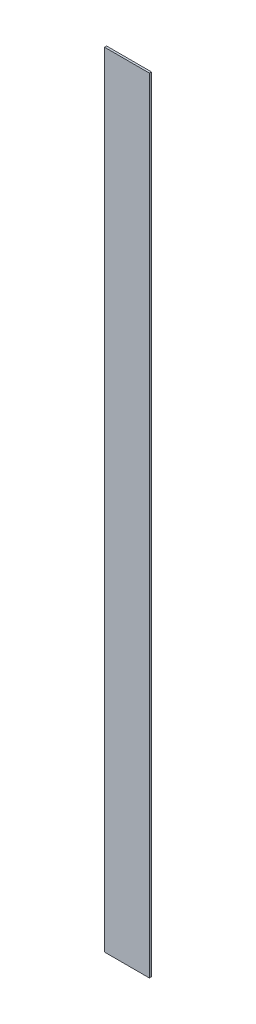
ISO-10303-21;
HEADER;
FILE_DESCRIPTION(('STEP AP214'),'2;1');
FILE_NAME('part.step','',(''),(''),'','','');
FILE_SCHEMA(('AUTOMOTIVE_DESIGN { 1 0 10303 214 1 1 1 1 }'));
ENDSEC;
DATA;
#1=APPLICATION_CONTEXT('core data for automotive mechanical design processes');
#2=APPLICATION_PROTOCOL_DEFINITION('international standard','automotive_design',2000,#1);
#3=PRODUCT_CONTEXT('',#1,'mechanical');
#4=PRODUCT('Part','Part','',(#3));
#5=PRODUCT_RELATED_PRODUCT_CATEGORY('part','',(#4));
#6=PRODUCT_DEFINITION_FORMATION('','',#4);
#7=PRODUCT_DEFINITION_CONTEXT('part definition',#1,'design');
#8=PRODUCT_DEFINITION('design','',#6,#7);
#9=PRODUCT_DEFINITION_SHAPE('','',#8);
#10=(LENGTH_UNIT() NAMED_UNIT(*) SI_UNIT(.MILLI.,.METRE.));
#11=(NAMED_UNIT(*) PLANE_ANGLE_UNIT() SI_UNIT($,.RADIAN.));
#12=(NAMED_UNIT(*) SI_UNIT($,.STERADIAN.) SOLID_ANGLE_UNIT());
#13=UNCERTAINTY_MEASURE_WITH_UNIT(LENGTH_MEASURE(1.E-05),#10,'distance_accuracy_value','');
#14=(GEOMETRIC_REPRESENTATION_CONTEXT(3) GLOBAL_UNCERTAINTY_ASSIGNED_CONTEXT((#13)) GLOBAL_UNIT_ASSIGNED_CONTEXT((#10,
#11,#12)) REPRESENTATION_CONTEXT('',''));
#15=CARTESIAN_POINT('',(0.,0.,0.));
#16=DIRECTION('',(0.,0.,1.));
#17=DIRECTION('',(1.,0.,0.));
#18=AXIS2_PLACEMENT_3D('',#15,#16,#17);
#19=CARTESIAN_POINT('',(-43.0000000000001,752.,4.));
#20=DIRECTION('',(1.,0.,0.));
#21=DIRECTION('',(0.,1.,0.));
#22=AXIS2_PLACEMENT_3D('',#19,#20,#21);
#23=PLANE('',#22);
#24=DIRECTION('',(0.,-1.,0.));
#25=VECTOR('',#24,1.);
#26=CARTESIAN_POINT('',(-43.0000000000001,752.,0.));
#27=LINE('',#26,#25);
#28=CARTESIAN_POINT('',(-43.0000000000001,752.,0.));
#29=VERTEX_POINT('',#28);
#30=CARTESIAN_POINT('',(-43.0000000000004,-752.,0.));
#31=VERTEX_POINT('',#30);
#32=EDGE_CURVE('E97',#29,#31,#27,.T.);
#33=ORIENTED_EDGE('',*,*,#32,.T.);
#34=DIRECTION('',(0.,0.,-1.));
#35=VECTOR('',#34,1.);
#36=CARTESIAN_POINT('',(-43.0000000000004,-752.,4.));
#37=LINE('',#36,#35);
#38=CARTESIAN_POINT('',(-43.0000000000004,-752.,4.));
#39=VERTEX_POINT('',#38);
#40=EDGE_CURVE('E11',#39,#31,#37,.T.);
#41=ORIENTED_EDGE('',*,*,#40,.F.);
#42=DIRECTION('',(0.,-1.,0.));
#43=VECTOR('',#42,1.);
#44=CARTESIAN_POINT('',(-43.0000000000001,752.,4.));
#45=LINE('',#44,#43);
#46=CARTESIAN_POINT('',(-43.0000000000001,752.,4.));
#47=VERTEX_POINT('',#46);
#48=EDGE_CURVE('E83',#47,#39,#45,.T.);
#49=ORIENTED_EDGE('',*,*,#48,.F.);
#50=DIRECTION('',(0.,0.,-1.));
#51=VECTOR('',#50,1.);
#52=CARTESIAN_POINT('',(-43.0000000000001,752.,4.));
#53=LINE('',#52,#51);
#54=EDGE_CURVE('E93',#47,#29,#53,.T.);
#55=ORIENTED_EDGE('',*,*,#54,.T.);
#56=EDGE_LOOP('',(#33,#41,#49,#55));
#57=FACE_BOUND('',#56,.T.);
#58=ADVANCED_FACE('F33',(#57),#23,.F.);
#59=CARTESIAN_POINT('',(-43.0000000000004,-752.,4.));
#60=DIRECTION('',(0.,1.,0.));
#61=DIRECTION('',(0.,0.,1.));
#62=AXIS2_PLACEMENT_3D('',#59,#60,#61);
#63=PLANE('',#62);
#64=DIRECTION('',(1.,0.,0.));
#65=VECTOR('',#64,1.);
#66=CARTESIAN_POINT('',(-43.0000000000004,-752.,0.));
#67=LINE('',#66,#65);
#68=CARTESIAN_POINT('',(43.0000000000004,-752.,0.));
#69=VERTEX_POINT('',#68);
#70=EDGE_CURVE('E88',#31,#69,#67,.T.);
#71=ORIENTED_EDGE('',*,*,#70,.T.);
#72=DIRECTION('',(0.,0.,-1.));
#73=VECTOR('',#72,1.);
#74=CARTESIAN_POINT('',(43.0000000000004,-752.,4.));
#75=LINE('',#74,#73);
#76=CARTESIAN_POINT('',(43.0000000000004,-752.,4.));
#77=VERTEX_POINT('',#76);
#78=EDGE_CURVE('E41',#77,#69,#75,.T.);
#79=ORIENTED_EDGE('',*,*,#78,.F.);
#80=DIRECTION('',(1.,0.,0.));
#81=VECTOR('',#80,1.);
#82=CARTESIAN_POINT('',(-43.0000000000004,-752.,4.));
#83=LINE('',#82,#81);
#84=EDGE_CURVE('E77',#39,#77,#83,.T.);
#85=ORIENTED_EDGE('',*,*,#84,.F.);
#86=ORIENTED_EDGE('',*,*,#40,.T.);
#87=EDGE_LOOP('',(#71,#79,#85,#86));
#88=FACE_BOUND('',#87,.T.);
#89=ADVANCED_FACE('F87',(#88),#63,.F.);
#90=CARTESIAN_POINT('',(43.0000000000004,-752.,4.));
#91=DIRECTION('',(-1.,0.,0.));
#92=DIRECTION('',(0.,-1.,0.));
#93=AXIS2_PLACEMENT_3D('',#90,#91,#92);
#94=PLANE('',#93);
#95=DIRECTION('',(0.,1.,0.));
#96=VECTOR('',#95,1.);
#97=CARTESIAN_POINT('',(43.0000000000004,-752.,0.));
#98=LINE('',#97,#96);
#99=CARTESIAN_POINT('',(43.0000000000006,752.,0.));
#100=VERTEX_POINT('',#99);
#101=EDGE_CURVE('E101',#69,#100,#98,.T.);
#102=ORIENTED_EDGE('',*,*,#101,.T.);
#103=DIRECTION('',(0.,0.,-1.));
#104=VECTOR('',#103,1.);
#105=CARTESIAN_POINT('',(43.0000000000006,752.,4.));
#106=LINE('',#105,#104);
#107=CARTESIAN_POINT('',(43.0000000000006,752.,4.));
#108=VERTEX_POINT('',#107);
#109=EDGE_CURVE('E90',#108,#100,#106,.T.);
#110=ORIENTED_EDGE('',*,*,#109,.F.);
#111=DIRECTION('',(0.,1.,0.));
#112=VECTOR('',#111,1.);
#113=CARTESIAN_POINT('',(43.0000000000004,-752.,4.));
#114=LINE('',#113,#112);
#115=EDGE_CURVE('E80',#77,#108,#114,.T.);
#116=ORIENTED_EDGE('',*,*,#115,.F.);
#117=ORIENTED_EDGE('',*,*,#78,.T.);
#118=EDGE_LOOP('',(#102,#110,#116,#117));
#119=FACE_BOUND('',#118,.T.);
#120=ADVANCED_FACE('F91',(#119),#94,.F.);
#121=CARTESIAN_POINT('',(-38.,752.,4.));
#122=DIRECTION('',(0.,-1.,0.));
#123=DIRECTION('',(0.,0.,-1.));
#124=AXIS2_PLACEMENT_3D('',#121,#122,#123);
#125=PLANE('',#124);
#126=DIRECTION('',(-1.,0.,0.));
#127=VECTOR('',#126,1.);
#128=CARTESIAN_POINT('',(-38.,752.,0.));
#129=LINE('',#128,#127);
#130=EDGE_CURVE('E66',#100,#29,#129,.T.);
#131=ORIENTED_EDGE('',*,*,#130,.T.);
#132=ORIENTED_EDGE('',*,*,#54,.F.);
#133=DIRECTION('',(-1.,0.,0.));
#134=VECTOR('',#133,1.);
#135=CARTESIAN_POINT('',(43.0000000000006,752.,4.));
#136=LINE('',#135,#134);
#137=EDGE_CURVE('E49',#108,#47,#136,.T.);
#138=ORIENTED_EDGE('',*,*,#137,.F.);
#139=ORIENTED_EDGE('',*,*,#109,.T.);
#140=EDGE_LOOP('',(#131,#132,#138,#139));
#141=FACE_BOUND('',#140,.T.);
#142=ADVANCED_FACE('F105',(#141),#125,.F.);
#143=CARTESIAN_POINT('',(0.,0.,4.));
#144=DIRECTION('',(0.,0.,1.));
#145=DIRECTION('',(1.,0.,0.));
#146=AXIS2_PLACEMENT_3D('',#143,#144,#145);
#147=PLANE('',#146);
#148=ORIENTED_EDGE('',*,*,#48,.T.);
#149=ORIENTED_EDGE('',*,*,#84,.T.);
#150=ORIENTED_EDGE('',*,*,#115,.T.);
#151=ORIENTED_EDGE('',*,*,#137,.T.);
#152=EDGE_LOOP('',(#148,#149,#150,#151));
#153=FACE_BOUND('',#152,.T.);
#154=ADVANCED_FACE('F78',(#153),#147,.T.);
#155=CARTESIAN_POINT('',(0.,0.,0.));
#156=DIRECTION('',(0.,0.,1.));
#157=DIRECTION('',(1.,0.,0.));
#158=AXIS2_PLACEMENT_3D('',#155,#156,#157);
#159=PLANE('',#158);
#160=ORIENTED_EDGE('',*,*,#32,.F.);
#161=ORIENTED_EDGE('',*,*,#130,.F.);
#162=ORIENTED_EDGE('',*,*,#101,.F.);
#163=ORIENTED_EDGE('',*,*,#70,.F.);
#164=EDGE_LOOP('',(#160,#161,#162,#163));
#165=FACE_BOUND('',#164,.T.);
#166=ADVANCED_FACE('F107',(#165),#159,.F.);
#167=CLOSED_SHELL('',(#58,#89,#120,#142,#154,#166));
#168=MANIFOLD_SOLID_BREP('B2',#167);
#169=ADVANCED_BREP_SHAPE_REPRESENTATION('',(#18,#168),#14);
#170=SHAPE_DEFINITION_REPRESENTATION(#9,#169);
ENDSEC;
END-ISO-10303-21;
